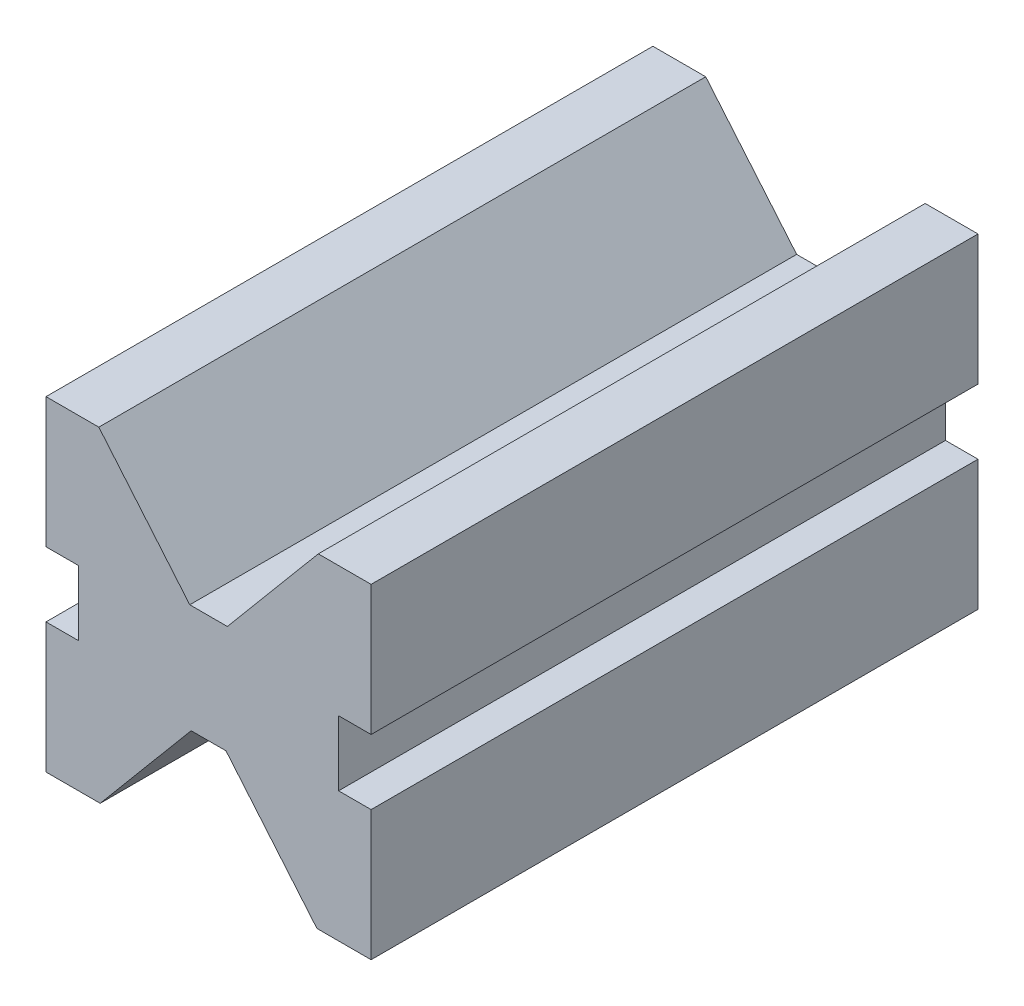
ISO-10303-21;
HEADER;
FILE_DESCRIPTION(('STEP AP214'),'2;1');
FILE_NAME('part.step','',(''),(''),'','','');
FILE_SCHEMA(('AUTOMOTIVE_DESIGN { 1 0 10303 214 1 1 1 1 }'));
ENDSEC;
DATA;
#1=APPLICATION_CONTEXT('core data for automotive mechanical design processes');
#2=APPLICATION_PROTOCOL_DEFINITION('international standard','automotive_design',2000,#1);
#3=PRODUCT_CONTEXT('',#1,'mechanical');
#4=PRODUCT('Part','Part','',(#3));
#5=PRODUCT_RELATED_PRODUCT_CATEGORY('part','',(#4));
#6=PRODUCT_DEFINITION_FORMATION('','',#4);
#7=PRODUCT_DEFINITION_CONTEXT('part definition',#1,'design');
#8=PRODUCT_DEFINITION('design','',#6,#7);
#9=PRODUCT_DEFINITION_SHAPE('','',#8);
#10=(LENGTH_UNIT() NAMED_UNIT(*) SI_UNIT(.MILLI.,.METRE.));
#11=(NAMED_UNIT(*) PLANE_ANGLE_UNIT() SI_UNIT($,.RADIAN.));
#12=(NAMED_UNIT(*) SI_UNIT($,.STERADIAN.) SOLID_ANGLE_UNIT());
#13=UNCERTAINTY_MEASURE_WITH_UNIT(LENGTH_MEASURE(1.E-05),#10,'distance_accuracy_value','');
#14=(GEOMETRIC_REPRESENTATION_CONTEXT(3) GLOBAL_UNCERTAINTY_ASSIGNED_CONTEXT((#13)) GLOBAL_UNIT_ASSIGNED_CONTEXT((#10,
#11,#12)) REPRESENTATION_CONTEXT('',''));
#15=CARTESIAN_POINT('',(0.,0.,0.));
#16=DIRECTION('',(0.,0.,1.));
#17=DIRECTION('',(1.,0.,0.));
#18=AXIS2_PLACEMENT_3D('',#15,#16,#17);
#19=CARTESIAN_POINT('',(-514.35,762.,2844.8));
#20=DIRECTION('',(0.,-1.,0.));
#21=DIRECTION('',(1.,0.,0.));
#22=AXIS2_PLACEMENT_3D('',#19,#20,#21);
#23=PLANE('',#22);
#24=DIRECTION('',(-1.,0.,0.));
#25=VECTOR('',#24,1.);
#26=CARTESIAN_POINT('',(-514.35,762.,0.));
#27=LINE('',#26,#25);
#28=CARTESIAN_POINT('',(-514.35,762.,0.));
#29=VERTEX_POINT('',#28);
#30=CARTESIAN_POINT('',(-762.,762.,0.));
#31=VERTEX_POINT('',#30);
#32=EDGE_CURVE('E201',#29,#31,#27,.T.);
#33=ORIENTED_EDGE('',*,*,#32,.T.);
#34=DIRECTION('',(0.,0.,-1.));
#35=VECTOR('',#34,1.);
#36=CARTESIAN_POINT('',(-762.,762.,2844.8));
#37=LINE('',#36,#35);
#38=CARTESIAN_POINT('',(-762.,762.,2844.8));
#39=VERTEX_POINT('',#38);
#40=EDGE_CURVE('E11',#39,#31,#37,.T.);
#41=ORIENTED_EDGE('',*,*,#40,.F.);
#42=DIRECTION('',(-1.,0.,0.));
#43=VECTOR('',#42,1.);
#44=CARTESIAN_POINT('',(-514.35,762.,2844.8));
#45=LINE('',#44,#43);
#46=CARTESIAN_POINT('',(-514.35,762.,2844.8));
#47=VERTEX_POINT('',#46);
#48=EDGE_CURVE('E239',#47,#39,#45,.T.);
#49=ORIENTED_EDGE('',*,*,#48,.F.);
#50=DIRECTION('',(0.,0.,-1.));
#51=VECTOR('',#50,1.);
#52=CARTESIAN_POINT('',(-514.35,762.,2844.8));
#53=LINE('',#52,#51);
#54=EDGE_CURVE('E197',#47,#29,#53,.T.);
#55=ORIENTED_EDGE('',*,*,#54,.T.);
#56=EDGE_LOOP('',(#33,#41,#49,#55));
#57=FACE_BOUND('',#56,.T.);
#58=ADVANCED_FACE('F33',(#57),#23,.F.);
#59=CARTESIAN_POINT('',(-762.,762.,2844.8));
#60=DIRECTION('',(1.,0.,0.));
#61=DIRECTION('',(0.,1.,0.));
#62=AXIS2_PLACEMENT_3D('',#59,#60,#61);
#63=PLANE('',#62);
#64=DIRECTION('',(0.,-1.,0.));
#65=VECTOR('',#64,1.);
#66=CARTESIAN_POINT('',(-762.,762.,0.));
#67=LINE('',#66,#65);
#68=CARTESIAN_POINT('',(-762.,152.4,0.));
#69=VERTEX_POINT('',#68);
#70=EDGE_CURVE('E204',#31,#69,#67,.T.);
#71=ORIENTED_EDGE('',*,*,#70,.T.);
#72=DIRECTION('',(0.,0.,-1.));
#73=VECTOR('',#72,1.);
#74=CARTESIAN_POINT('',(-762.,152.4,2844.8));
#75=LINE('',#74,#73);
#76=CARTESIAN_POINT('',(-762.,152.4,2844.8));
#77=VERTEX_POINT('',#76);
#78=EDGE_CURVE('E41',#77,#69,#75,.T.);
#79=ORIENTED_EDGE('',*,*,#78,.F.);
#80=DIRECTION('',(0.,-1.,0.));
#81=VECTOR('',#80,1.);
#82=CARTESIAN_POINT('',(-762.,762.,2844.8));
#83=LINE('',#82,#81);
#84=EDGE_CURVE('E128',#39,#77,#83,.T.);
#85=ORIENTED_EDGE('',*,*,#84,.F.);
#86=ORIENTED_EDGE('',*,*,#40,.T.);
#87=EDGE_LOOP('',(#71,#79,#85,#86));
#88=FACE_BOUND('',#87,.T.);
#89=ADVANCED_FACE('F357',(#88),#63,.F.);
#90=CARTESIAN_POINT('',(-762.,152.4,2844.8));
#91=DIRECTION('',(0.,1.,0.));
#92=DIRECTION('',(-1.,0.,0.));
#93=AXIS2_PLACEMENT_3D('',#90,#91,#92);
#94=PLANE('',#93);
#95=DIRECTION('',(1.,0.,0.));
#96=VECTOR('',#95,1.);
#97=CARTESIAN_POINT('',(-762.,152.4,0.));
#98=LINE('',#97,#96);
#99=CARTESIAN_POINT('',(-609.6,152.4,0.));
#100=VERTEX_POINT('',#99);
#101=EDGE_CURVE('E206',#69,#100,#98,.T.);
#102=ORIENTED_EDGE('',*,*,#101,.T.);
#103=DIRECTION('',(0.,0.,-1.));
#104=VECTOR('',#103,1.);
#105=CARTESIAN_POINT('',(-609.6,152.4,2844.8));
#106=LINE('',#105,#104);
#107=CARTESIAN_POINT('',(-609.6,152.4,2844.8));
#108=VERTEX_POINT('',#107);
#109=EDGE_CURVE('E282',#108,#100,#106,.T.);
#110=ORIENTED_EDGE('',*,*,#109,.F.);
#111=DIRECTION('',(1.,0.,0.));
#112=VECTOR('',#111,1.);
#113=CARTESIAN_POINT('',(-762.,152.4,2844.8));
#114=LINE('',#113,#112);
#115=EDGE_CURVE('E290',#77,#108,#114,.T.);
#116=ORIENTED_EDGE('',*,*,#115,.F.);
#117=ORIENTED_EDGE('',*,*,#78,.T.);
#118=EDGE_LOOP('',(#102,#110,#116,#117));
#119=FACE_BOUND('',#118,.T.);
#120=ADVANCED_FACE('F288',(#119),#94,.F.);
#121=CARTESIAN_POINT('',(-609.6,152.4,2844.8));
#122=DIRECTION('',(1.,0.,0.));
#123=DIRECTION('',(0.,0.,-1.));
#124=AXIS2_PLACEMENT_3D('',#121,#122,#123);
#125=PLANE('',#124);
#126=DIRECTION('',(0.,-1.,0.));
#127=VECTOR('',#126,1.);
#128=CARTESIAN_POINT('',(-609.6,152.4,0.));
#129=LINE('',#128,#127);
#130=CARTESIAN_POINT('',(-609.6,-152.4,0.));
#131=VERTEX_POINT('',#130);
#132=EDGE_CURVE('E208',#100,#131,#129,.T.);
#133=ORIENTED_EDGE('',*,*,#132,.T.);
#134=DIRECTION('',(0.,0.,-1.));
#135=VECTOR('',#134,1.);
#136=CARTESIAN_POINT('',(-609.6,-152.4,2844.8));
#137=LINE('',#136,#135);
#138=CARTESIAN_POINT('',(-609.6,-152.4,2844.8));
#139=VERTEX_POINT('',#138);
#140=EDGE_CURVE('E279',#139,#131,#137,.T.);
#141=ORIENTED_EDGE('',*,*,#140,.F.);
#142=DIRECTION('',(0.,-1.,0.));
#143=VECTOR('',#142,1.);
#144=CARTESIAN_POINT('',(-609.6,152.4,2844.8));
#145=LINE('',#144,#143);
#146=EDGE_CURVE('E308',#108,#139,#145,.T.);
#147=ORIENTED_EDGE('',*,*,#146,.F.);
#148=ORIENTED_EDGE('',*,*,#109,.T.);
#149=EDGE_LOOP('',(#133,#141,#147,#148));
#150=FACE_BOUND('',#149,.T.);
#151=ADVANCED_FACE('F299',(#150),#125,.F.);
#152=CARTESIAN_POINT('',(-609.6,-152.4,2844.8));
#153=DIRECTION('',(0.,-1.,0.));
#154=DIRECTION('',(1.,0.,0.));
#155=AXIS2_PLACEMENT_3D('',#152,#153,#154);
#156=PLANE('',#155);
#157=DIRECTION('',(-1.,0.,0.));
#158=VECTOR('',#157,1.);
#159=CARTESIAN_POINT('',(-609.6,-152.4,0.));
#160=LINE('',#159,#158);
#161=CARTESIAN_POINT('',(-762.,-152.4,0.));
#162=VERTEX_POINT('',#161);
#163=EDGE_CURVE('E210',#131,#162,#160,.T.);
#164=ORIENTED_EDGE('',*,*,#163,.T.);
#165=DIRECTION('',(0.,0.,-1.));
#166=VECTOR('',#165,1.);
#167=CARTESIAN_POINT('',(-762.,-152.4,2844.8));
#168=LINE('',#167,#166);
#169=CARTESIAN_POINT('',(-762.,-152.4,2844.8));
#170=VERTEX_POINT('',#169);
#171=EDGE_CURVE('E276',#170,#162,#168,.T.);
#172=ORIENTED_EDGE('',*,*,#171,.F.);
#173=DIRECTION('',(-1.,0.,0.));
#174=VECTOR('',#173,1.);
#175=CARTESIAN_POINT('',(-609.6,-152.4,2844.8));
#176=LINE('',#175,#174);
#177=EDGE_CURVE('E305',#139,#170,#176,.T.);
#178=ORIENTED_EDGE('',*,*,#177,.F.);
#179=ORIENTED_EDGE('',*,*,#140,.T.);
#180=EDGE_LOOP('',(#164,#172,#178,#179));
#181=FACE_BOUND('',#180,.T.);
#182=ADVANCED_FACE('F303',(#181),#156,.F.);
#183=CARTESIAN_POINT('',(-762.,-152.4,2844.8));
#184=DIRECTION('',(1.,0.,0.));
#185=DIRECTION('',(0.,1.,0.));
#186=AXIS2_PLACEMENT_3D('',#183,#184,#185);
#187=PLANE('',#186);
#188=DIRECTION('',(0.,-1.,0.));
#189=VECTOR('',#188,1.);
#190=CARTESIAN_POINT('',(-762.,-152.4,0.));
#191=LINE('',#190,#189);
#192=CARTESIAN_POINT('',(-762.,-762.,0.));
#193=VERTEX_POINT('',#192);
#194=EDGE_CURVE('E212',#162,#193,#191,.T.);
#195=ORIENTED_EDGE('',*,*,#194,.T.);
#196=DIRECTION('',(0.,0.,-1.));
#197=VECTOR('',#196,1.);
#198=CARTESIAN_POINT('',(-762.,-762.,2844.8));
#199=LINE('',#198,#197);
#200=CARTESIAN_POINT('',(-762.,-762.,2844.8));
#201=VERTEX_POINT('',#200);
#202=EDGE_CURVE('E273',#201,#193,#199,.T.);
#203=ORIENTED_EDGE('',*,*,#202,.F.);
#204=DIRECTION('',(0.,-1.,0.));
#205=VECTOR('',#204,1.);
#206=CARTESIAN_POINT('',(-762.,-152.4,2844.8));
#207=LINE('',#206,#205);
#208=EDGE_CURVE('E307',#170,#201,#207,.T.);
#209=ORIENTED_EDGE('',*,*,#208,.F.);
#210=ORIENTED_EDGE('',*,*,#171,.T.);
#211=EDGE_LOOP('',(#195,#203,#209,#210));
#212=FACE_BOUND('',#211,.T.);
#213=ADVANCED_FACE('F370',(#212),#187,.F.);
#214=CARTESIAN_POINT('',(-762.,-762.,2844.8));
#215=DIRECTION('',(0.,1.,0.));
#216=DIRECTION('',(-1.,0.,0.));
#217=AXIS2_PLACEMENT_3D('',#214,#215,#216);
#218=PLANE('',#217);
#219=DIRECTION('',(1.,0.,0.));
#220=VECTOR('',#219,1.);
#221=CARTESIAN_POINT('',(-762.,-762.,0.));
#222=LINE('',#221,#220);
#223=CARTESIAN_POINT('',(-508.,-762.,0.));
#224=VERTEX_POINT('',#223);
#225=EDGE_CURVE('E214',#193,#224,#222,.T.);
#226=ORIENTED_EDGE('',*,*,#225,.T.);
#227=DIRECTION('',(0.,0.,-1.));
#228=VECTOR('',#227,1.);
#229=CARTESIAN_POINT('',(-508.,-762.,2844.8));
#230=LINE('',#229,#228);
#231=CARTESIAN_POINT('',(-508.,-762.,2844.8));
#232=VERTEX_POINT('',#231);
#233=EDGE_CURVE('E270',#232,#224,#230,.T.);
#234=ORIENTED_EDGE('',*,*,#233,.F.);
#235=DIRECTION('',(1.,0.,0.));
#236=VECTOR('',#235,1.);
#237=CARTESIAN_POINT('',(-762.,-762.,2844.8));
#238=LINE('',#237,#236);
#239=EDGE_CURVE('E310',#201,#232,#238,.T.);
#240=ORIENTED_EDGE('',*,*,#239,.F.);
#241=ORIENTED_EDGE('',*,*,#202,.T.);
#242=EDGE_LOOP('',(#226,#234,#240,#241));
#243=FACE_BOUND('',#242,.T.);
#244=ADVANCED_FACE('F373',(#243),#218,.F.);
#245=CARTESIAN_POINT('',(-508.,-762.,2844.8));
#246=DIRECTION('',(-0.766044443118974,0.642787609686543,0.));
#247=DIRECTION('',(-0.642787609686544,-0.766044443118975,0.));
#248=AXIS2_PLACEMENT_3D('',#245,#246,#247);
#249=PLANE('',#248);
#250=DIRECTION('',(0.642787609686544,0.766044443118974,0.));
#251=VECTOR('',#250,1.);
#252=CARTESIAN_POINT('',(-508.,-762.,0.));
#253=LINE('',#252,#251);
#254=CARTESIAN_POINT('',(-81.7373873619371,-254.,0.));
#255=VERTEX_POINT('',#254);
#256=EDGE_CURVE('E216',#224,#255,#253,.T.);
#257=ORIENTED_EDGE('',*,*,#256,.T.);
#258=DIRECTION('',(0.,0.,-1.));
#259=VECTOR('',#258,1.);
#260=CARTESIAN_POINT('',(-81.7373873619371,-254.,2844.8));
#261=LINE('',#260,#259);
#262=CARTESIAN_POINT('',(-81.7373873619371,-254.,2844.8));
#263=VERTEX_POINT('',#262);
#264=EDGE_CURVE('E267',#263,#255,#261,.T.);
#265=ORIENTED_EDGE('',*,*,#264,.F.);
#266=DIRECTION('',(0.642787609686544,0.766044443118974,0.));
#267=VECTOR('',#266,1.);
#268=CARTESIAN_POINT('',(-508.,-762.,2844.8));
#269=LINE('',#268,#267);
#270=EDGE_CURVE('E316',#232,#263,#269,.T.);
#271=ORIENTED_EDGE('',*,*,#270,.F.);
#272=ORIENTED_EDGE('',*,*,#233,.T.);
#273=EDGE_LOOP('',(#257,#265,#271,#272));
#274=FACE_BOUND('',#273,.T.);
#275=ADVANCED_FACE('F377',(#274),#249,.F.);
#276=CARTESIAN_POINT('',(81.7373873619373,-254.,2844.8));
#277=DIRECTION('',(0.,1.,0.));
#278=DIRECTION('',(0.,0.,1.));
#279=AXIS2_PLACEMENT_3D('',#276,#277,#278);
#280=PLANE('',#279);
#281=DIRECTION('',(1.,0.,0.));
#282=VECTOR('',#281,1.);
#283=CARTESIAN_POINT('',(81.7373873619373,-254.,0.));
#284=LINE('',#283,#282);
#285=CARTESIAN_POINT('',(81.7373873619373,-254.,0.));
#286=VERTEX_POINT('',#285);
#287=EDGE_CURVE('E218',#255,#286,#284,.T.);
#288=ORIENTED_EDGE('',*,*,#287,.T.);
#289=DIRECTION('',(0.,0.,-1.));
#290=VECTOR('',#289,1.);
#291=CARTESIAN_POINT('',(81.7373873619373,-254.,2844.8));
#292=LINE('',#291,#290);
#293=CARTESIAN_POINT('',(81.7373873619373,-254.,2844.8));
#294=VERTEX_POINT('',#293);
#295=EDGE_CURVE('E264',#294,#286,#292,.T.);
#296=ORIENTED_EDGE('',*,*,#295,.F.);
#297=DIRECTION('',(1.,0.,0.));
#298=VECTOR('',#297,1.);
#299=CARTESIAN_POINT('',(81.7373873619373,-254.,2844.8));
#300=LINE('',#299,#298);
#301=EDGE_CURVE('E318',#263,#294,#300,.T.);
#302=ORIENTED_EDGE('',*,*,#301,.F.);
#303=ORIENTED_EDGE('',*,*,#264,.T.);
#304=EDGE_LOOP('',(#288,#296,#302,#303));
#305=FACE_BOUND('',#304,.T.);
#306=ADVANCED_FACE('F381',(#305),#280,.F.);
#307=CARTESIAN_POINT('',(508.,-762.,2844.8));
#308=DIRECTION('',(0.766044443118974,0.642787609686544,0.));
#309=DIRECTION('',(-0.642787609686544,0.766044443118974,0.));
#310=AXIS2_PLACEMENT_3D('',#307,#308,#309);
#311=PLANE('',#310);
#312=DIRECTION('',(0.642787609686544,-0.766044443118974,0.));
#313=VECTOR('',#312,1.);
#314=CARTESIAN_POINT('',(508.,-762.,0.));
#315=LINE('',#314,#313);
#316=CARTESIAN_POINT('',(508.,-762.,0.));
#317=VERTEX_POINT('',#316);
#318=EDGE_CURVE('E220',#286,#317,#315,.T.);
#319=ORIENTED_EDGE('',*,*,#318,.T.);
#320=DIRECTION('',(0.,0.,-1.));
#321=VECTOR('',#320,1.);
#322=CARTESIAN_POINT('',(508.,-762.,2844.8));
#323=LINE('',#322,#321);
#324=CARTESIAN_POINT('',(508.,-762.,2844.8));
#325=VERTEX_POINT('',#324);
#326=EDGE_CURVE('E261',#325,#317,#323,.T.);
#327=ORIENTED_EDGE('',*,*,#326,.F.);
#328=DIRECTION('',(0.642787609686544,-0.766044443118974,0.));
#329=VECTOR('',#328,1.);
#330=CARTESIAN_POINT('',(508.,-762.,2844.8));
#331=LINE('',#330,#329);
#332=EDGE_CURVE('E320',#294,#325,#331,.T.);
#333=ORIENTED_EDGE('',*,*,#332,.F.);
#334=ORIENTED_EDGE('',*,*,#295,.T.);
#335=EDGE_LOOP('',(#319,#327,#333,#334));
#336=FACE_BOUND('',#335,.T.);
#337=ADVANCED_FACE('F385',(#336),#311,.F.);
#338=CARTESIAN_POINT('',(762.,-762.,2844.8));
#339=DIRECTION('',(0.,1.,0.));
#340=DIRECTION('',(-1.,0.,0.));
#341=AXIS2_PLACEMENT_3D('',#338,#339,#340);
#342=PLANE('',#341);
#343=DIRECTION('',(1.,0.,0.));
#344=VECTOR('',#343,1.);
#345=CARTESIAN_POINT('',(762.,-762.,0.));
#346=LINE('',#345,#344);
#347=CARTESIAN_POINT('',(762.,-762.,0.));
#348=VERTEX_POINT('',#347);
#349=EDGE_CURVE('E222',#317,#348,#346,.T.);
#350=ORIENTED_EDGE('',*,*,#349,.T.);
#351=DIRECTION('',(0.,0.,-1.));
#352=VECTOR('',#351,1.);
#353=CARTESIAN_POINT('',(762.,-762.,2844.8));
#354=LINE('',#353,#352);
#355=CARTESIAN_POINT('',(762.,-762.,2844.8));
#356=VERTEX_POINT('',#355);
#357=EDGE_CURVE('E258',#356,#348,#354,.T.);
#358=ORIENTED_EDGE('',*,*,#357,.F.);
#359=DIRECTION('',(1.,0.,0.));
#360=VECTOR('',#359,1.);
#361=CARTESIAN_POINT('',(762.,-762.,2844.8));
#362=LINE('',#361,#360);
#363=EDGE_CURVE('E322',#325,#356,#362,.T.);
#364=ORIENTED_EDGE('',*,*,#363,.F.);
#365=ORIENTED_EDGE('',*,*,#326,.T.);
#366=EDGE_LOOP('',(#350,#358,#364,#365));
#367=FACE_BOUND('',#366,.T.);
#368=ADVANCED_FACE('F389',(#367),#342,.F.);
#369=CARTESIAN_POINT('',(762.,-152.4,2844.8));
#370=DIRECTION('',(-1.,0.,0.));
#371=DIRECTION('',(0.,-1.,0.));
#372=AXIS2_PLACEMENT_3D('',#369,#370,#371);
#373=PLANE('',#372);
#374=DIRECTION('',(0.,1.,0.));
#375=VECTOR('',#374,1.);
#376=CARTESIAN_POINT('',(762.,-152.4,0.));
#377=LINE('',#376,#375);
#378=CARTESIAN_POINT('',(762.,-152.4,0.));
#379=VERTEX_POINT('',#378);
#380=EDGE_CURVE('E224',#348,#379,#377,.T.);
#381=ORIENTED_EDGE('',*,*,#380,.T.);
#382=DIRECTION('',(0.,0.,-1.));
#383=VECTOR('',#382,1.);
#384=CARTESIAN_POINT('',(762.,-152.4,2844.8));
#385=LINE('',#384,#383);
#386=CARTESIAN_POINT('',(762.,-152.4,2844.8));
#387=VERTEX_POINT('',#386);
#388=EDGE_CURVE('E255',#387,#379,#385,.T.);
#389=ORIENTED_EDGE('',*,*,#388,.F.);
#390=DIRECTION('',(0.,1.,0.));
#391=VECTOR('',#390,1.);
#392=CARTESIAN_POINT('',(762.,-152.4,2844.8));
#393=LINE('',#392,#391);
#394=EDGE_CURVE('E324',#356,#387,#393,.T.);
#395=ORIENTED_EDGE('',*,*,#394,.F.);
#396=ORIENTED_EDGE('',*,*,#357,.T.);
#397=EDGE_LOOP('',(#381,#389,#395,#396));
#398=FACE_BOUND('',#397,.T.);
#399=ADVANCED_FACE('F393',(#398),#373,.F.);
#400=CARTESIAN_POINT('',(609.6,-152.4,2844.8));
#401=DIRECTION('',(0.,-1.,0.));
#402=DIRECTION('',(0.,0.,-1.));
#403=AXIS2_PLACEMENT_3D('',#400,#401,#402);
#404=PLANE('',#403);
#405=DIRECTION('',(-1.,0.,0.));
#406=VECTOR('',#405,1.);
#407=CARTESIAN_POINT('',(609.6,-152.4,0.));
#408=LINE('',#407,#406);
#409=CARTESIAN_POINT('',(609.6,-152.4,0.));
#410=VERTEX_POINT('',#409);
#411=EDGE_CURVE('E226',#379,#410,#408,.T.);
#412=ORIENTED_EDGE('',*,*,#411,.T.);
#413=DIRECTION('',(0.,0.,-1.));
#414=VECTOR('',#413,1.);
#415=CARTESIAN_POINT('',(609.6,-152.4,2844.8));
#416=LINE('',#415,#414);
#417=CARTESIAN_POINT('',(609.6,-152.4,2844.8));
#418=VERTEX_POINT('',#417);
#419=EDGE_CURVE('E252',#418,#410,#416,.T.);
#420=ORIENTED_EDGE('',*,*,#419,.F.);
#421=DIRECTION('',(-1.,0.,0.));
#422=VECTOR('',#421,1.);
#423=CARTESIAN_POINT('',(609.6,-152.4,2844.8));
#424=LINE('',#423,#422);
#425=EDGE_CURVE('E326',#387,#418,#424,.T.);
#426=ORIENTED_EDGE('',*,*,#425,.F.);
#427=ORIENTED_EDGE('',*,*,#388,.T.);
#428=EDGE_LOOP('',(#412,#420,#426,#427));
#429=FACE_BOUND('',#428,.T.);
#430=ADVANCED_FACE('F397',(#429),#404,.F.);
#431=CARTESIAN_POINT('',(609.6,152.4,2844.8));
#432=DIRECTION('',(-1.,0.,0.));
#433=DIRECTION('',(0.,0.,1.));
#434=AXIS2_PLACEMENT_3D('',#431,#432,#433);
#435=PLANE('',#434);
#436=DIRECTION('',(0.,1.,0.));
#437=VECTOR('',#436,1.);
#438=CARTESIAN_POINT('',(609.6,152.4,0.));
#439=LINE('',#438,#437);
#440=CARTESIAN_POINT('',(609.6,152.4,0.));
#441=VERTEX_POINT('',#440);
#442=EDGE_CURVE('E228',#410,#441,#439,.T.);
#443=ORIENTED_EDGE('',*,*,#442,.T.);
#444=DIRECTION('',(0.,0.,-1.));
#445=VECTOR('',#444,1.);
#446=CARTESIAN_POINT('',(609.6,152.4,2844.8));
#447=LINE('',#446,#445);
#448=CARTESIAN_POINT('',(609.6,152.4,2844.8));
#449=VERTEX_POINT('',#448);
#450=EDGE_CURVE('E249',#449,#441,#447,.T.);
#451=ORIENTED_EDGE('',*,*,#450,.F.);
#452=DIRECTION('',(0.,1.,0.));
#453=VECTOR('',#452,1.);
#454=CARTESIAN_POINT('',(609.6,152.4,2844.8));
#455=LINE('',#454,#453);
#456=EDGE_CURVE('E328',#418,#449,#455,.T.);
#457=ORIENTED_EDGE('',*,*,#456,.F.);
#458=ORIENTED_EDGE('',*,*,#419,.T.);
#459=EDGE_LOOP('',(#443,#451,#457,#458));
#460=FACE_BOUND('',#459,.T.);
#461=ADVANCED_FACE('F401',(#460),#435,.F.);
#462=CARTESIAN_POINT('',(762.,152.4,2844.8));
#463=DIRECTION('',(0.,1.,0.));
#464=DIRECTION('',(0.,0.,1.));
#465=AXIS2_PLACEMENT_3D('',#462,#463,#464);
#466=PLANE('',#465);
#467=DIRECTION('',(1.,0.,0.));
#468=VECTOR('',#467,1.);
#469=CARTESIAN_POINT('',(762.,152.4,0.));
#470=LINE('',#469,#468);
#471=CARTESIAN_POINT('',(762.,152.4,0.));
#472=VERTEX_POINT('',#471);
#473=EDGE_CURVE('E230',#441,#472,#470,.T.);
#474=ORIENTED_EDGE('',*,*,#473,.T.);
#475=DIRECTION('',(0.,0.,-1.));
#476=VECTOR('',#475,1.);
#477=CARTESIAN_POINT('',(762.,152.4,2844.8));
#478=LINE('',#477,#476);
#479=CARTESIAN_POINT('',(762.,152.4,2844.8));
#480=VERTEX_POINT('',#479);
#481=EDGE_CURVE('E246',#480,#472,#478,.T.);
#482=ORIENTED_EDGE('',*,*,#481,.F.);
#483=DIRECTION('',(1.,0.,0.));
#484=VECTOR('',#483,1.);
#485=CARTESIAN_POINT('',(762.,152.4,2844.8));
#486=LINE('',#485,#484);
#487=EDGE_CURVE('E330',#449,#480,#486,.T.);
#488=ORIENTED_EDGE('',*,*,#487,.F.);
#489=ORIENTED_EDGE('',*,*,#450,.T.);
#490=EDGE_LOOP('',(#474,#482,#488,#489));
#491=FACE_BOUND('',#490,.T.);
#492=ADVANCED_FACE('F405',(#491),#466,.F.);
#493=CARTESIAN_POINT('',(762.,762.,2844.8));
#494=DIRECTION('',(-1.,0.,0.));
#495=DIRECTION('',(0.,-1.,0.));
#496=AXIS2_PLACEMENT_3D('',#493,#494,#495);
#497=PLANE('',#496);
#498=DIRECTION('',(0.,1.,0.));
#499=VECTOR('',#498,1.);
#500=CARTESIAN_POINT('',(762.,762.,0.));
#501=LINE('',#500,#499);
#502=CARTESIAN_POINT('',(762.,762.,0.));
#503=VERTEX_POINT('',#502);
#504=EDGE_CURVE('E232',#472,#503,#501,.T.);
#505=ORIENTED_EDGE('',*,*,#504,.T.);
#506=DIRECTION('',(0.,0.,-1.));
#507=VECTOR('',#506,1.);
#508=CARTESIAN_POINT('',(762.,762.,2844.8));
#509=LINE('',#508,#507);
#510=CARTESIAN_POINT('',(762.,762.,2844.8));
#511=VERTEX_POINT('',#510);
#512=EDGE_CURVE('E243',#511,#503,#509,.T.);
#513=ORIENTED_EDGE('',*,*,#512,.F.);
#514=DIRECTION('',(0.,1.,0.));
#515=VECTOR('',#514,1.);
#516=CARTESIAN_POINT('',(762.,762.,2844.8));
#517=LINE('',#516,#515);
#518=EDGE_CURVE('E332',#480,#511,#517,.T.);
#519=ORIENTED_EDGE('',*,*,#518,.F.);
#520=ORIENTED_EDGE('',*,*,#481,.T.);
#521=EDGE_LOOP('',(#505,#513,#519,#520));
#522=FACE_BOUND('',#521,.T.);
#523=ADVANCED_FACE('F338',(#522),#497,.F.);
#524=CARTESIAN_POINT('',(514.35,762.,2844.8));
#525=DIRECTION('',(0.,-1.,0.));
#526=DIRECTION('',(0.,0.,-1.));
#527=AXIS2_PLACEMENT_3D('',#524,#525,#526);
#528=PLANE('',#527);
#529=DIRECTION('',(-1.,0.,0.));
#530=VECTOR('',#529,1.);
#531=CARTESIAN_POINT('',(514.35,762.,0.));
#532=LINE('',#531,#530);
#533=CARTESIAN_POINT('',(514.35,762.,0.));
#534=VERTEX_POINT('',#533);
#535=EDGE_CURVE('E234',#503,#534,#532,.T.);
#536=ORIENTED_EDGE('',*,*,#535,.T.);
#537=DIRECTION('',(0.,0.,-1.));
#538=VECTOR('',#537,1.);
#539=CARTESIAN_POINT('',(514.35,762.,2844.8));
#540=LINE('',#539,#538);
#541=CARTESIAN_POINT('',(514.35,762.,2844.8));
#542=VERTEX_POINT('',#541);
#543=EDGE_CURVE('E192',#542,#534,#540,.T.);
#544=ORIENTED_EDGE('',*,*,#543,.F.);
#545=DIRECTION('',(-1.,0.,0.));
#546=VECTOR('',#545,1.);
#547=CARTESIAN_POINT('',(514.35,762.,2844.8));
#548=LINE('',#547,#546);
#549=EDGE_CURVE('E183',#511,#542,#548,.T.);
#550=ORIENTED_EDGE('',*,*,#549,.F.);
#551=ORIENTED_EDGE('',*,*,#512,.T.);
#552=EDGE_LOOP('',(#536,#544,#550,#551));
#553=FACE_BOUND('',#552,.T.);
#554=ADVANCED_FACE('F342',(#553),#528,.F.);
#555=CARTESIAN_POINT('',(88.0873873619439,254.,2844.8));
#556=DIRECTION('',(0.766044443118979,-0.642787609686538,0.));
#557=DIRECTION('',(0.642787609686538,0.766044443118979,0.));
#558=AXIS2_PLACEMENT_3D('',#555,#556,#557);
#559=PLANE('',#558);
#560=DIRECTION('',(-0.642787609686538,-0.766044443118979,0.));
#561=VECTOR('',#560,1.);
#562=CARTESIAN_POINT('',(88.0873873619439,254.,0.));
#563=LINE('',#562,#561);
#564=CARTESIAN_POINT('',(88.0873873619439,254.,0.));
#565=VERTEX_POINT('',#564);
#566=EDGE_CURVE('E191',#534,#565,#563,.T.);
#567=ORIENTED_EDGE('',*,*,#566,.T.);
#568=DIRECTION('',(0.,0.,-1.));
#569=VECTOR('',#568,1.);
#570=CARTESIAN_POINT('',(88.0873873619439,254.,2844.8));
#571=LINE('',#570,#569);
#572=CARTESIAN_POINT('',(88.0873873619439,254.,2844.8));
#573=VERTEX_POINT('',#572);
#574=EDGE_CURVE('E188',#573,#565,#571,.T.);
#575=ORIENTED_EDGE('',*,*,#574,.F.);
#576=DIRECTION('',(-0.642787609686538,-0.766044443118979,0.));
#577=VECTOR('',#576,1.);
#578=CARTESIAN_POINT('',(88.0873873619439,254.,2844.8));
#579=LINE('',#578,#577);
#580=EDGE_CURVE('E177',#542,#573,#579,.T.);
#581=ORIENTED_EDGE('',*,*,#580,.F.);
#582=ORIENTED_EDGE('',*,*,#543,.T.);
#583=EDGE_LOOP('',(#567,#575,#581,#582));
#584=FACE_BOUND('',#583,.T.);
#585=ADVANCED_FACE('F189',(#584),#559,.F.);
#586=CARTESIAN_POINT('',(-88.0873873619437,254.,2844.8));
#587=DIRECTION('',(0.,-1.,0.));
#588=DIRECTION('',(0.,0.,-1.));
#589=AXIS2_PLACEMENT_3D('',#586,#587,#588);
#590=PLANE('',#589);
#591=DIRECTION('',(-1.,0.,0.));
#592=VECTOR('',#591,1.);
#593=CARTESIAN_POINT('',(-88.0873873619437,254.,0.));
#594=LINE('',#593,#592);
#595=CARTESIAN_POINT('',(-88.0873873619437,254.,0.));
#596=VERTEX_POINT('',#595);
#597=EDGE_CURVE('E114',#565,#596,#594,.T.);
#598=ORIENTED_EDGE('',*,*,#597,.T.);
#599=DIRECTION('',(0.,0.,-1.));
#600=VECTOR('',#599,1.);
#601=CARTESIAN_POINT('',(-88.0873873619437,254.,2844.8));
#602=LINE('',#601,#600);
#603=CARTESIAN_POINT('',(-88.0873873619437,254.,2844.8));
#604=VERTEX_POINT('',#603);
#605=EDGE_CURVE('E193',#604,#596,#602,.T.);
#606=ORIENTED_EDGE('',*,*,#605,.F.);
#607=DIRECTION('',(-1.,0.,0.));
#608=VECTOR('',#607,1.);
#609=CARTESIAN_POINT('',(-88.0873873619437,254.,2844.8));
#610=LINE('',#609,#608);
#611=EDGE_CURVE('E181',#573,#604,#610,.T.);
#612=ORIENTED_EDGE('',*,*,#611,.F.);
#613=ORIENTED_EDGE('',*,*,#574,.T.);
#614=EDGE_LOOP('',(#598,#606,#612,#613));
#615=FACE_BOUND('',#614,.T.);
#616=ADVANCED_FACE('F195',(#615),#590,.F.);
#617=CARTESIAN_POINT('',(-88.0873873619437,254.,2844.8));
#618=DIRECTION('',(-0.766044443118979,-0.642787609686538,0.));
#619=DIRECTION('',(0.642787609686538,-0.766044443118979,0.));
#620=AXIS2_PLACEMENT_3D('',#617,#618,#619);
#621=PLANE('',#620);
#622=DIRECTION('',(-0.642787609686538,0.766044443118979,0.));
#623=VECTOR('',#622,1.);
#624=CARTESIAN_POINT('',(-88.0873873619437,254.,0.));
#625=LINE('',#624,#623);
#626=EDGE_CURVE('E120',#596,#29,#625,.T.);
#627=ORIENTED_EDGE('',*,*,#626,.T.);
#628=ORIENTED_EDGE('',*,*,#54,.F.);
#629=DIRECTION('',(-0.642787609686538,0.766044443118979,0.));
#630=VECTOR('',#629,1.);
#631=CARTESIAN_POINT('',(-88.0873873619437,254.,2844.8));
#632=LINE('',#631,#630);
#633=EDGE_CURVE('E49',#604,#47,#632,.T.);
#634=ORIENTED_EDGE('',*,*,#633,.F.);
#635=ORIENTED_EDGE('',*,*,#605,.T.);
#636=EDGE_LOOP('',(#627,#628,#634,#635));
#637=FACE_BOUND('',#636,.T.);
#638=ADVANCED_FACE('F346',(#637),#621,.F.);
#639=CARTESIAN_POINT('',(0.,0.,2844.8));
#640=DIRECTION('',(0.,0.,1.));
#641=DIRECTION('',(1.,0.,0.));
#642=AXIS2_PLACEMENT_3D('',#639,#640,#641);
#643=PLANE('',#642);
#644=ORIENTED_EDGE('',*,*,#48,.T.);
#645=ORIENTED_EDGE('',*,*,#84,.T.);
#646=ORIENTED_EDGE('',*,*,#115,.T.);
#647=ORIENTED_EDGE('',*,*,#146,.T.);
#648=ORIENTED_EDGE('',*,*,#177,.T.);
#649=ORIENTED_EDGE('',*,*,#208,.T.);
#650=ORIENTED_EDGE('',*,*,#239,.T.);
#651=ORIENTED_EDGE('',*,*,#270,.T.);
#652=ORIENTED_EDGE('',*,*,#301,.T.);
#653=ORIENTED_EDGE('',*,*,#332,.T.);
#654=ORIENTED_EDGE('',*,*,#363,.T.);
#655=ORIENTED_EDGE('',*,*,#394,.T.);
#656=ORIENTED_EDGE('',*,*,#425,.T.);
#657=ORIENTED_EDGE('',*,*,#456,.T.);
#658=ORIENTED_EDGE('',*,*,#487,.T.);
#659=ORIENTED_EDGE('',*,*,#518,.T.);
#660=ORIENTED_EDGE('',*,*,#549,.T.);
#661=ORIENTED_EDGE('',*,*,#580,.T.);
#662=ORIENTED_EDGE('',*,*,#611,.T.);
#663=ORIENTED_EDGE('',*,*,#633,.T.);
#664=EDGE_LOOP('',(#644,#645,#646,#647,#648,#649,#650,#651,#652,#653,#654,#655,#656,#657,#658,
#659,#660,#661,#662,#663));
#665=FACE_BOUND('',#664,.T.);
#666=ADVANCED_FACE('F179',(#665),#643,.T.);
#667=CARTESIAN_POINT('',(0.,0.,0.));
#668=DIRECTION('',(0.,0.,1.));
#669=DIRECTION('',(1.,0.,0.));
#670=AXIS2_PLACEMENT_3D('',#667,#668,#669);
#671=PLANE('',#670);
#672=ORIENTED_EDGE('',*,*,#32,.F.);
#673=ORIENTED_EDGE('',*,*,#626,.F.);
#674=ORIENTED_EDGE('',*,*,#597,.F.);
#675=ORIENTED_EDGE('',*,*,#566,.F.);
#676=ORIENTED_EDGE('',*,*,#535,.F.);
#677=ORIENTED_EDGE('',*,*,#504,.F.);
#678=ORIENTED_EDGE('',*,*,#473,.F.);
#679=ORIENTED_EDGE('',*,*,#442,.F.);
#680=ORIENTED_EDGE('',*,*,#411,.F.);
#681=ORIENTED_EDGE('',*,*,#380,.F.);
#682=ORIENTED_EDGE('',*,*,#349,.F.);
#683=ORIENTED_EDGE('',*,*,#318,.F.);
#684=ORIENTED_EDGE('',*,*,#287,.F.);
#685=ORIENTED_EDGE('',*,*,#256,.F.);
#686=ORIENTED_EDGE('',*,*,#225,.F.);
#687=ORIENTED_EDGE('',*,*,#194,.F.);
#688=ORIENTED_EDGE('',*,*,#163,.F.);
#689=ORIENTED_EDGE('',*,*,#132,.F.);
#690=ORIENTED_EDGE('',*,*,#101,.F.);
#691=ORIENTED_EDGE('',*,*,#70,.F.);
#692=EDGE_LOOP('',(#672,#673,#674,#675,#676,#677,#678,#679,#680,#681,#682,#683,#684,#685,#686,
#687,#688,#689,#690,#691));
#693=FACE_BOUND('',#692,.T.);
#694=ADVANCED_FACE('F294',(#693),#671,.F.);
#695=CLOSED_SHELL('',(#58,#89,#120,#151,#182,#213,#244,#275,#306,#337,#368,#399,#430,#461,#492,
#523,#554,#585,#616,#638,#666,#694));
#696=MANIFOLD_SOLID_BREP('B2',#695);
#697=ADVANCED_BREP_SHAPE_REPRESENTATION('',(#18,#696),#14);
#698=SHAPE_DEFINITION_REPRESENTATION(#9,#697);
ENDSEC;
END-ISO-10303-21;
